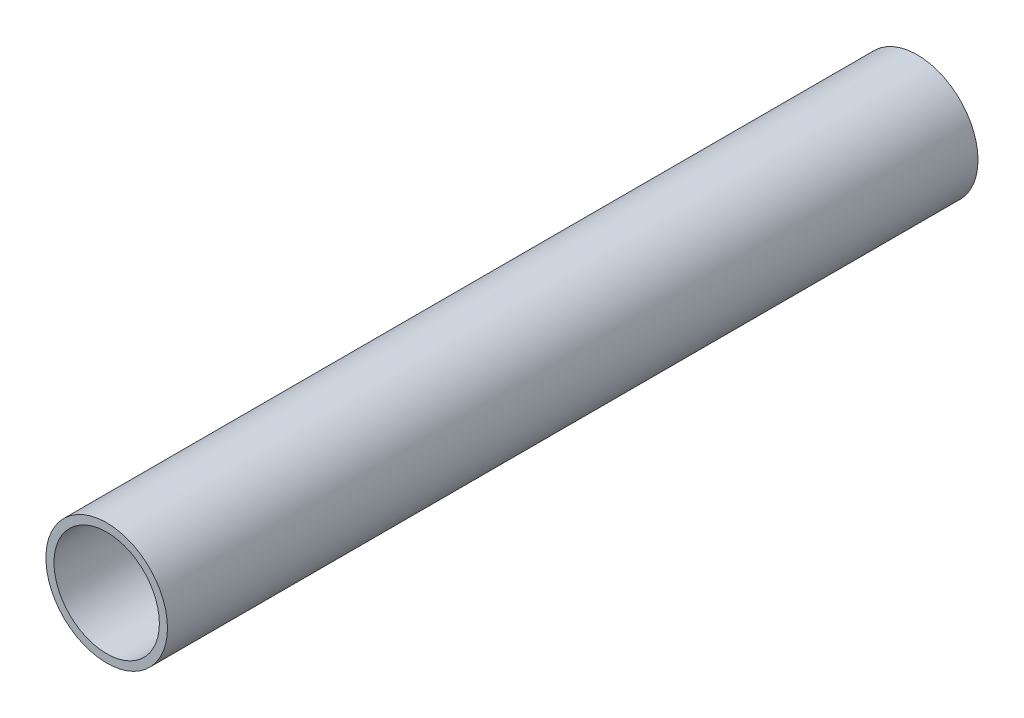
ISO-10303-21;
HEADER;
FILE_DESCRIPTION(('STEP AP214'),'2;1');
FILE_NAME('part.step','',(''),(''),'','','');
FILE_SCHEMA(('AUTOMOTIVE_DESIGN { 1 0 10303 214 1 1 1 1 }'));
ENDSEC;
DATA;
#1=APPLICATION_CONTEXT('core data for automotive mechanical design processes');
#2=APPLICATION_PROTOCOL_DEFINITION('international standard','automotive_design',2000,#1);
#3=PRODUCT_CONTEXT('',#1,'mechanical');
#4=PRODUCT('Part','Part','',(#3));
#5=PRODUCT_RELATED_PRODUCT_CATEGORY('part','',(#4));
#6=PRODUCT_DEFINITION_FORMATION('','',#4);
#7=PRODUCT_DEFINITION_CONTEXT('part definition',#1,'design');
#8=PRODUCT_DEFINITION('design','',#6,#7);
#9=PRODUCT_DEFINITION_SHAPE('','',#8);
#10=(LENGTH_UNIT() NAMED_UNIT(*) SI_UNIT(.MILLI.,.METRE.));
#11=(NAMED_UNIT(*) PLANE_ANGLE_UNIT() SI_UNIT($,.RADIAN.));
#12=(NAMED_UNIT(*) SI_UNIT($,.STERADIAN.) SOLID_ANGLE_UNIT());
#13=UNCERTAINTY_MEASURE_WITH_UNIT(LENGTH_MEASURE(1.E-05),#10,'distance_accuracy_value','');
#14=(GEOMETRIC_REPRESENTATION_CONTEXT(3) GLOBAL_UNCERTAINTY_ASSIGNED_CONTEXT((#13)) GLOBAL_UNIT_ASSIGNED_CONTEXT((#10,
#11,#12)) REPRESENTATION_CONTEXT('',''));
#15=CARTESIAN_POINT('',(0.,0.,0.));
#16=DIRECTION('',(0.,0.,1.));
#17=DIRECTION('',(1.,0.,0.));
#18=AXIS2_PLACEMENT_3D('',#15,#16,#17);
#19=CARTESIAN_POINT('',(0.,0.,1000.));
#20=DIRECTION('',(0.,0.,-1.));
#21=DIRECTION('',(-1.,0.,0.));
#22=AXIS2_PLACEMENT_3D('',#19,#20,#21);
#23=CYLINDRICAL_SURFACE('',#22,75.);
#24=CARTESIAN_POINT('',(0.,0.,1000.));
#25=DIRECTION('',(0.,0.,1.));
#26=DIRECTION('',(1.,0.,0.));
#27=AXIS2_PLACEMENT_3D('',#24,#25,#26);
#28=CIRCLE('',#27,75.);
#29=CARTESIAN_POINT('',(75.,0.,1000.));
#30=VERTEX_POINT('',#29);
#31=EDGE_CURVE('E11',#30,#30,#28,.T.);
#32=ORIENTED_EDGE('',*,*,#31,.F.);
#33=EDGE_LOOP('',(#32));
#34=FACE_BOUND('',#33,.T.);
#35=CARTESIAN_POINT('',(0.,0.,0.));
#36=DIRECTION('',(0.,0.,1.));
#37=DIRECTION('',(1.,0.,0.));
#38=AXIS2_PLACEMENT_3D('',#35,#36,#37);
#39=CIRCLE('',#38,75.);
#40=CARTESIAN_POINT('',(75.,0.,0.));
#41=VERTEX_POINT('',#40);
#42=EDGE_CURVE('E46',#41,#41,#39,.T.);
#43=ORIENTED_EDGE('',*,*,#42,.T.);
#44=EDGE_LOOP('',(#43));
#45=FACE_BOUND('',#44,.T.);
#46=ADVANCED_FACE('F43',(#34,#45),#23,.T.);
#47=CARTESIAN_POINT('',(0.,0.,1000.));
#48=DIRECTION('',(0.,0.,1.));
#49=DIRECTION('',(1.,0.,0.));
#50=AXIS2_PLACEMENT_3D('',#47,#48,#49);
#51=PLANE('',#50);
#52=CARTESIAN_POINT('',(0.,0.,1000.));
#53=DIRECTION('',(0.,0.,1.));
#54=DIRECTION('',(1.,0.,0.));
#55=AXIS2_PLACEMENT_3D('',#52,#53,#54);
#56=CIRCLE('',#55,65.);
#57=CARTESIAN_POINT('',(65.,0.,1000.));
#58=VERTEX_POINT('',#57);
#59=EDGE_CURVE('E58',#58,#58,#56,.T.);
#60=ORIENTED_EDGE('',*,*,#59,.F.);
#61=EDGE_LOOP('',(#60));
#62=FACE_BOUND('',#61,.T.);
#63=ORIENTED_EDGE('',*,*,#31,.T.);
#64=EDGE_LOOP('',(#63));
#65=FACE_BOUND('',#64,.T.);
#66=ADVANCED_FACE('F74',(#62,#65),#51,.T.);
#67=CARTESIAN_POINT('',(0.,0.,0.));
#68=DIRECTION('',(0.,0.,1.));
#69=DIRECTION('',(1.,0.,0.));
#70=AXIS2_PLACEMENT_3D('',#67,#68,#69);
#71=PLANE('',#70);
#72=CARTESIAN_POINT('',(0.,0.,0.));
#73=DIRECTION('',(0.,0.,1.));
#74=DIRECTION('',(1.,0.,0.));
#75=AXIS2_PLACEMENT_3D('',#72,#73,#74);
#76=CIRCLE('',#75,65.);
#77=CARTESIAN_POINT('',(65.,0.,0.));
#78=VERTEX_POINT('',#77);
#79=EDGE_CURVE('E56',#78,#78,#76,.T.);
#80=ORIENTED_EDGE('',*,*,#79,.T.);
#81=EDGE_LOOP('',(#80));
#82=FACE_BOUND('',#81,.T.);
#83=ORIENTED_EDGE('',*,*,#42,.F.);
#84=EDGE_LOOP('',(#83));
#85=FACE_BOUND('',#84,.T.);
#86=ADVANCED_FACE('F76',(#82,#85),#71,.F.);
#87=CARTESIAN_POINT('',(0.,0.,0.));
#88=DIRECTION('',(0.,0.,1.));
#89=DIRECTION('',(1.,0.,0.));
#90=AXIS2_PLACEMENT_3D('',#87,#88,#89);
#91=CYLINDRICAL_SURFACE('',#90,65.);
#92=ORIENTED_EDGE('',*,*,#79,.F.);
#93=EDGE_LOOP('',(#92));
#94=FACE_BOUND('',#93,.T.);
#95=ORIENTED_EDGE('',*,*,#59,.T.);
#96=EDGE_LOOP('',(#95));
#97=FACE_BOUND('',#96,.T.);
#98=ADVANCED_FACE('F72',(#94,#97),#91,.F.);
#99=CLOSED_SHELL('',(#46,#66,#86,#98));
#100=MANIFOLD_SOLID_BREP('B2',#99);
#101=ADVANCED_BREP_SHAPE_REPRESENTATION('',(#18,#100),#14);
#102=SHAPE_DEFINITION_REPRESENTATION(#9,#101);
ENDSEC;
END-ISO-10303-21;
